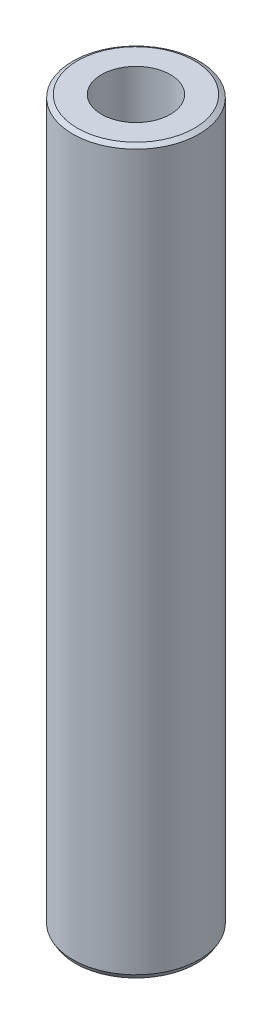
ISO-10303-21;
HEADER;
FILE_DESCRIPTION(('STEP AP214'),'2;1');
FILE_NAME('part.step','',(''),(''),'','','');
FILE_SCHEMA(('AUTOMOTIVE_DESIGN { 1 0 10303 214 1 1 1 1 }'));
ENDSEC;
DATA;
#1=APPLICATION_CONTEXT('core data for automotive mechanical design processes');
#2=APPLICATION_PROTOCOL_DEFINITION('international standard','automotive_design',2000,#1);
#3=PRODUCT_CONTEXT('',#1,'mechanical');
#4=PRODUCT('Part','Part','',(#3));
#5=PRODUCT_RELATED_PRODUCT_CATEGORY('part','',(#4));
#6=PRODUCT_DEFINITION_FORMATION('','',#4);
#7=PRODUCT_DEFINITION_CONTEXT('part definition',#1,'design');
#8=PRODUCT_DEFINITION('design','',#6,#7);
#9=PRODUCT_DEFINITION_SHAPE('','',#8);
#10=(LENGTH_UNIT() NAMED_UNIT(*) SI_UNIT(.MILLI.,.METRE.));
#11=(NAMED_UNIT(*) PLANE_ANGLE_UNIT() SI_UNIT($,.RADIAN.));
#12=(NAMED_UNIT(*) SI_UNIT($,.STERADIAN.) SOLID_ANGLE_UNIT());
#13=UNCERTAINTY_MEASURE_WITH_UNIT(LENGTH_MEASURE(1.E-05),#10,'distance_accuracy_value','');
#14=(GEOMETRIC_REPRESENTATION_CONTEXT(3) GLOBAL_UNCERTAINTY_ASSIGNED_CONTEXT((#13)) GLOBAL_UNIT_ASSIGNED_CONTEXT((#10,
#11,#12)) REPRESENTATION_CONTEXT('',''));
#15=CARTESIAN_POINT('',(0.,0.,0.));
#16=DIRECTION('',(0.,0.,1.));
#17=DIRECTION('',(1.,0.,0.));
#18=AXIS2_PLACEMENT_3D('',#15,#16,#17);
#19=CARTESIAN_POINT('',(0.,600.,0.));
#20=DIRECTION('',(0.,-1.,0.));
#21=DIRECTION('',(0.,0.,-1.));
#22=AXIS2_PLACEMENT_3D('',#19,#20,#21);
#23=CYLINDRICAL_SURFACE('',#22,52.5);
#24=CARTESIAN_POINT('',(0.,597.742584136246,0.));
#25=DIRECTION('',(0.,1.,0.));
#26=DIRECTION('',(0.,0.,1.));
#27=AXIS2_PLACEMENT_3D('',#24,#25,#26);
#28=CIRCLE('',#27,52.5);
#29=CARTESIAN_POINT('',(0.,597.742584136246,52.5));
#30=VERTEX_POINT('',#29);
#31=EDGE_CURVE('E50',#30,#30,#28,.F.);
#32=ORIENTED_EDGE('',*,*,#31,.T.);
#33=EDGE_LOOP('',(#32));
#34=FACE_BOUND('',#33,.T.);
#35=CARTESIAN_POINT('',(0.,3.90995896983393,0.));
#36=DIRECTION('',(0.,1.,0.));
#37=DIRECTION('',(0.,0.,1.));
#38=AXIS2_PLACEMENT_3D('',#35,#36,#37);
#39=CIRCLE('',#38,52.5);
#40=CARTESIAN_POINT('',(0.,3.90995896983393,52.5));
#41=VERTEX_POINT('',#40);
#42=EDGE_CURVE('E51',#41,#41,#39,.T.);
#43=ORIENTED_EDGE('',*,*,#42,.T.);
#44=EDGE_LOOP('',(#43));
#45=FACE_BOUND('',#44,.T.);
#46=ADVANCED_FACE('F39',(#34,#45),#23,.T.);
#47=CARTESIAN_POINT('',(0.,600.,0.));
#48=DIRECTION('',(0.,1.,0.));
#49=DIRECTION('',(0.,0.,1.));
#50=AXIS2_PLACEMENT_3D('',#47,#48,#49);
#51=PLANE('',#50);
#52=CARTESIAN_POINT('',(0.,600.,0.));
#53=DIRECTION('',(0.,1.,0.));
#54=DIRECTION('',(0.,0.,1.));
#55=AXIS2_PLACEMENT_3D('',#52,#53,#54);
#56=CIRCLE('',#55,48.5900410301661);
#57=CARTESIAN_POINT('',(0.,600.,48.5900410301661));
#58=VERTEX_POINT('',#57);
#59=EDGE_CURVE('E54',#58,#58,#56,.T.);
#60=ORIENTED_EDGE('',*,*,#59,.T.);
#61=EDGE_LOOP('',(#60));
#62=FACE_BOUND('',#61,.T.);
#63=CARTESIAN_POINT('',(0.,600.,0.));
#64=DIRECTION('',(0.,1.,0.));
#65=DIRECTION('',(0.,0.,1.));
#66=AXIS2_PLACEMENT_3D('',#63,#64,#65);
#67=CIRCLE('',#66,28.6177253305297);
#68=CARTESIAN_POINT('',(0.,600.,28.6177253305297));
#69=VERTEX_POINT('',#68);
#70=EDGE_CURVE('E58',#69,#69,#67,.T.);
#71=ORIENTED_EDGE('',*,*,#70,.F.);
#72=EDGE_LOOP('',(#71));
#73=FACE_BOUND('',#72,.T.);
#74=ADVANCED_FACE('F69',(#62,#73),#51,.T.);
#75=CARTESIAN_POINT('',(0.,0.,0.));
#76=DIRECTION('',(0.,1.,0.));
#77=DIRECTION('',(0.,0.,1.));
#78=AXIS2_PLACEMENT_3D('',#75,#76,#77);
#79=PLANE('',#78);
#80=CARTESIAN_POINT('',(0.,0.,0.));
#81=DIRECTION('',(0.,1.,0.));
#82=DIRECTION('',(0.,0.,1.));
#83=AXIS2_PLACEMENT_3D('',#80,#81,#82);
#84=CIRCLE('',#83,50.242584136246);
#85=CARTESIAN_POINT('',(0.,0.,50.242584136246));
#86=VERTEX_POINT('',#85);
#87=EDGE_CURVE('E10',#86,#86,#84,.F.);
#88=ORIENTED_EDGE('',*,*,#87,.T.);
#89=EDGE_LOOP('',(#88));
#90=FACE_BOUND('',#89,.T.);
#91=CARTESIAN_POINT('',(0.,0.,0.));
#92=DIRECTION('',(0.,1.,0.));
#93=DIRECTION('',(0.,0.,1.));
#94=AXIS2_PLACEMENT_3D('',#91,#92,#93);
#95=CIRCLE('',#94,28.6177253305297);
#96=CARTESIAN_POINT('',(0.,0.,28.6177253305297));
#97=VERTEX_POINT('',#96);
#98=EDGE_CURVE('E63',#97,#97,#95,.T.);
#99=ORIENTED_EDGE('',*,*,#98,.T.);
#100=EDGE_LOOP('',(#99));
#101=FACE_BOUND('',#100,.T.);
#102=ADVANCED_FACE('F75',(#90,#101),#79,.F.);
#103=CARTESIAN_POINT('',(0.,600.,0.));
#104=DIRECTION('',(0.,-1.,0.));
#105=DIRECTION('',(0.,0.,-1.));
#106=AXIS2_PLACEMENT_3D('',#103,#104,#105);
#107=CYLINDRICAL_SURFACE('',#106,28.6177253305297);
#108=ORIENTED_EDGE('',*,*,#70,.T.);
#109=EDGE_LOOP('',(#108));
#110=FACE_BOUND('',#109,.T.);
#111=ORIENTED_EDGE('',*,*,#98,.F.);
#112=EDGE_LOOP('',(#111));
#113=FACE_BOUND('',#112,.T.);
#114=ADVANCED_FACE('F70',(#110,#113),#107,.F.);
#115=CARTESIAN_POINT('',(0.,600.,0.));
#116=DIRECTION('',(0.,-1.,0.));
#117=DIRECTION('',(0.,0.,-1.));
#118=AXIS2_PLACEMENT_3D('',#115,#116,#117);
#119=CONICAL_SURFACE('',#118,48.5900410301661,1.04719755119659);
#120=ORIENTED_EDGE('',*,*,#31,.F.);
#121=EDGE_LOOP('',(#120));
#122=FACE_BOUND('',#121,.T.);
#123=ORIENTED_EDGE('',*,*,#59,.F.);
#124=EDGE_LOOP('',(#123));
#125=FACE_BOUND('',#124,.T.);
#126=ADVANCED_FACE('F81',(#122,#125),#119,.T.);
#127=CARTESIAN_POINT('',(0.,3.90995896983393,0.));
#128=DIRECTION('',(0.,1.,0.));
#129=DIRECTION('',(0.,0.,1.));
#130=AXIS2_PLACEMENT_3D('',#127,#128,#129);
#131=CONICAL_SURFACE('',#130,52.5,0.523598775598298);
#132=ORIENTED_EDGE('',*,*,#87,.F.);
#133=EDGE_LOOP('',(#132));
#134=FACE_BOUND('',#133,.T.);
#135=ORIENTED_EDGE('',*,*,#42,.F.);
#136=EDGE_LOOP('',(#135));
#137=FACE_BOUND('',#136,.T.);
#138=ADVANCED_FACE('F45',(#134,#137),#131,.T.);
#139=CLOSED_SHELL('',(#46,#74,#102,#114,#126,#138));
#140=MANIFOLD_SOLID_BREP('B2',#139);
#141=ADVANCED_BREP_SHAPE_REPRESENTATION('',(#18,#140),#14);
#142=SHAPE_DEFINITION_REPRESENTATION(#9,#141);
ENDSEC;
END-ISO-10303-21;
